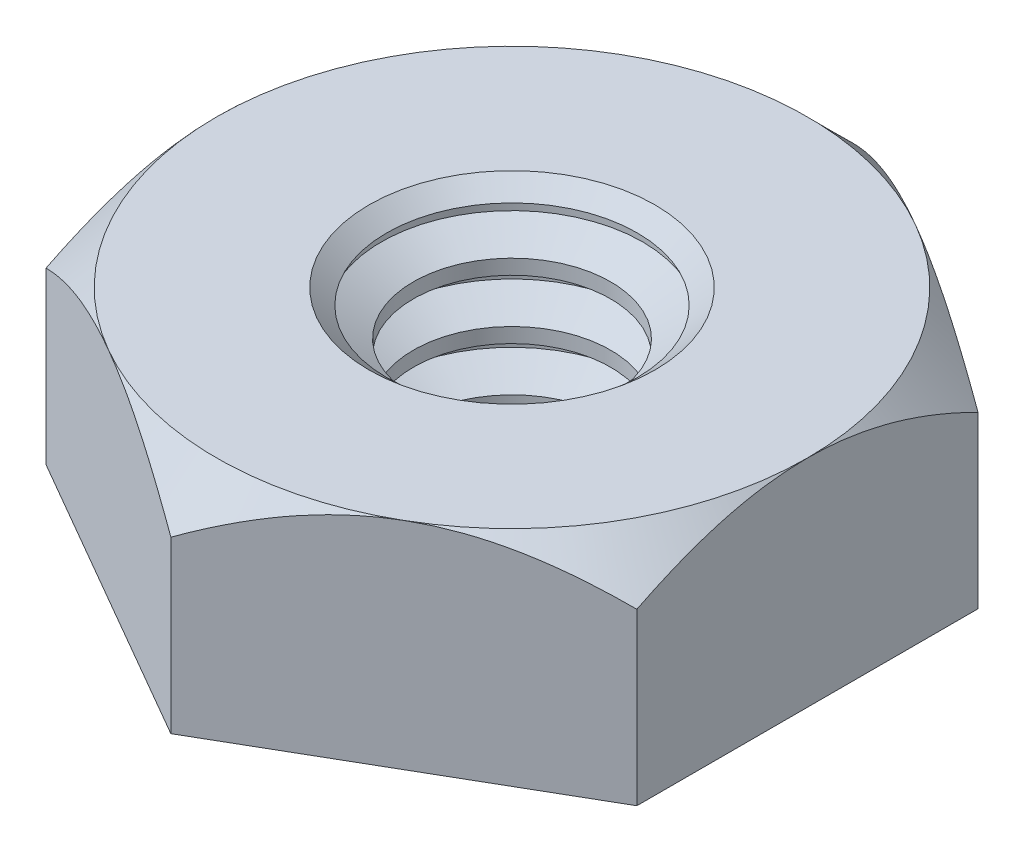
ISO-10303-21;
HEADER;
FILE_DESCRIPTION(('STEP AP214'),'2;1');
FILE_NAME('part.step','',(''),(''),'','','');
FILE_SCHEMA(('AUTOMOTIVE_DESIGN { 1 0 10303 214 1 1 1 1 }'));
ENDSEC;
DATA;
#1=APPLICATION_CONTEXT('core data for automotive mechanical design processes');
#2=APPLICATION_PROTOCOL_DEFINITION('international standard','automotive_design',2000,#1);
#3=PRODUCT_CONTEXT('',#1,'mechanical');
#4=PRODUCT('Part','Part','',(#3));
#5=PRODUCT_RELATED_PRODUCT_CATEGORY('part','',(#4));
#6=PRODUCT_DEFINITION_FORMATION('','',#4);
#7=PRODUCT_DEFINITION_CONTEXT('part definition',#1,'design');
#8=PRODUCT_DEFINITION('design','',#6,#7);
#9=PRODUCT_DEFINITION_SHAPE('','',#8);
#10=(LENGTH_UNIT() NAMED_UNIT(*) SI_UNIT(.MILLI.,.METRE.));
#11=(NAMED_UNIT(*) PLANE_ANGLE_UNIT() SI_UNIT($,.RADIAN.));
#12=(NAMED_UNIT(*) SI_UNIT($,.STERADIAN.) SOLID_ANGLE_UNIT());
#13=UNCERTAINTY_MEASURE_WITH_UNIT(LENGTH_MEASURE(1.E-05),#10,'distance_accuracy_value','');
#14=(GEOMETRIC_REPRESENTATION_CONTEXT(3) GLOBAL_UNCERTAINTY_ASSIGNED_CONTEXT((#13)) GLOBAL_UNIT_ASSIGNED_CONTEXT((#10,
#11,#12)) REPRESENTATION_CONTEXT('',''));
#15=CARTESIAN_POINT('',(0.,0.,0.));
#16=DIRECTION('',(0.,0.,1.));
#17=DIRECTION('',(1.,0.,0.));
#18=AXIS2_PLACEMENT_3D('',#15,#16,#17);
#19=CARTESIAN_POINT('',(-3.9624,0.,-6.86307811991092));
#20=DIRECTION('',(0.,1.,0.));
#21=DIRECTION('',(0.,0.,1.));
#22=AXIS2_PLACEMENT_3D('',#19,#20,#21);
#23=PLANE('',#22);
#24=DIRECTION('',(-0.866025403784439,0.,-0.5));
#25=VECTOR('',#24,1.);
#26=CARTESIAN_POINT('',(3.9624,0.,-2.28769270663698));
#27=LINE('',#26,#25);
#28=CARTESIAN_POINT('',(3.9624,0.,-2.28769270663698));
#29=VERTEX_POINT('',#28);
#30=CARTESIAN_POINT('',(0.,0.,-4.57538541327395));
#31=VERTEX_POINT('',#30);
#32=EDGE_CURVE('E271',#29,#31,#27,.T.);
#33=ORIENTED_EDGE('',*,*,#32,.F.);
#34=DIRECTION('',(0.,0.,-1.));
#35=VECTOR('',#34,1.);
#36=CARTESIAN_POINT('',(3.9624,0.,2.28769270663697));
#37=LINE('',#36,#35);
#38=CARTESIAN_POINT('',(3.9624,0.,2.28769270663697));
#39=VERTEX_POINT('',#38);
#40=EDGE_CURVE('E278',#39,#29,#37,.T.);
#41=ORIENTED_EDGE('',*,*,#40,.F.);
#42=DIRECTION('',(0.866025403784439,0.,-0.5));
#43=VECTOR('',#42,1.);
#44=CARTESIAN_POINT('',(0.,0.,4.57538541327395));
#45=LINE('',#44,#43);
#46=CARTESIAN_POINT('',(0.,0.,4.57538541327395));
#47=VERTEX_POINT('',#46);
#48=EDGE_CURVE('E274',#47,#39,#45,.T.);
#49=ORIENTED_EDGE('',*,*,#48,.F.);
#50=DIRECTION('',(0.866025403784439,0.,0.5));
#51=VECTOR('',#50,1.);
#52=CARTESIAN_POINT('',(-3.9624,0.,2.28769270663697));
#53=LINE('',#52,#51);
#54=CARTESIAN_POINT('',(-3.9624,0.,2.28769270663697));
#55=VERTEX_POINT('',#54);
#56=EDGE_CURVE('E126',#55,#47,#53,.T.);
#57=ORIENTED_EDGE('',*,*,#56,.F.);
#58=DIRECTION('',(0.,0.,1.));
#59=VECTOR('',#58,1.);
#60=CARTESIAN_POINT('',(-3.9624,0.,-2.28769270663698));
#61=LINE('',#60,#59);
#62=CARTESIAN_POINT('',(-3.9624,0.,-2.28769270663698));
#63=VERTEX_POINT('',#62);
#64=EDGE_CURVE('E270',#63,#55,#61,.T.);
#65=ORIENTED_EDGE('',*,*,#64,.F.);
#66=DIRECTION('',(-0.866025403784439,0.,0.5));
#67=VECTOR('',#66,1.);
#68=CARTESIAN_POINT('',(0.,0.,-4.57538541327395));
#69=LINE('',#68,#67);
#70=EDGE_CURVE('E266',#31,#63,#69,.T.);
#71=ORIENTED_EDGE('',*,*,#70,.F.);
#72=EDGE_LOOP('',(#33,#41,#49,#57,#65,#71));
#73=FACE_BOUND('',#72,.T.);
#74=CARTESIAN_POINT('',(0.,0.,0.));
#75=DIRECTION('',(0.,1.,0.));
#76=DIRECTION('',(0.,0.,1.));
#77=AXIS2_PLACEMENT_3D('',#74,#75,#76);
#78=CIRCLE('',#77,1.46320137334911);
#79=CARTESIAN_POINT('',(0.,0.,1.46320137334911));
#80=VERTEX_POINT('',#79);
#81=EDGE_CURVE('E143',#80,#80,#78,.F.);
#82=ORIENTED_EDGE('',*,*,#81,.F.);
#83=EDGE_LOOP('',(#82));
#84=FACE_BOUND('',#83,.T.);
#85=ADVANCED_FACE('F33',(#73,#84),#23,.F.);
#86=CARTESIAN_POINT('',(-3.9624,2.8956,-6.86307811991092));
#87=DIRECTION('',(0.,1.,0.));
#88=DIRECTION('',(0.,0.,1.));
#89=AXIS2_PLACEMENT_3D('',#86,#87,#88);
#90=PLANE('',#89);
#91=CARTESIAN_POINT('',(0.,2.8956,0.));
#92=DIRECTION('',(0.,1.,0.));
#93=DIRECTION('',(0.,0.,1.));
#94=AXIS2_PLACEMENT_3D('',#91,#92,#93);
#95=CIRCLE('',#94,1.91828270984131);
#96=CARTESIAN_POINT('',(0.,2.8956,1.91828270984131));
#97=VERTEX_POINT('',#96);
#98=EDGE_CURVE('E12',#97,#97,#95,.F.);
#99=ORIENTED_EDGE('',*,*,#98,.T.);
#100=EDGE_LOOP('',(#99));
#101=FACE_BOUND('',#100,.T.);
#102=CARTESIAN_POINT('',(0.,2.8956,0.));
#103=DIRECTION('',(0.,1.,0.));
#104=DIRECTION('',(0.,0.,1.));
#105=AXIS2_PLACEMENT_3D('',#102,#103,#104);
#106=CIRCLE('',#105,3.9624);
#107=CARTESIAN_POINT('',(-1.9812,2.8956,3.43153905995546));
#108=VERTEX_POINT('',#107);
#109=CARTESIAN_POINT('',(1.9812,2.8956,3.43153905995546));
#110=VERTEX_POINT('',#109);
#111=EDGE_CURVE('E108',#108,#110,#106,.T.);
#112=ORIENTED_EDGE('',*,*,#111,.T.);
#113=CARTESIAN_POINT('',(0.,2.8956,0.));
#114=DIRECTION('',(0.,1.,0.));
#115=DIRECTION('',(0.,0.,1.));
#116=AXIS2_PLACEMENT_3D('',#113,#114,#115);
#117=CIRCLE('',#116,3.9624);
#118=CARTESIAN_POINT('',(3.9624,2.8956,0.));
#119=VERTEX_POINT('',#118);
#120=EDGE_CURVE('E48',#110,#119,#117,.T.);
#121=ORIENTED_EDGE('',*,*,#120,.T.);
#122=CARTESIAN_POINT('',(1.9812,2.8956,-3.43153905995546));
#123=VERTEX_POINT('',#122);
#124=EDGE_CURVE('E142',#119,#123,#106,.T.);
#125=ORIENTED_EDGE('',*,*,#124,.T.);
#126=CARTESIAN_POINT('',(-1.9812,2.8956,-3.43153905995546));
#127=VERTEX_POINT('',#126);
#128=EDGE_CURVE('E150',#123,#127,#106,.T.);
#129=ORIENTED_EDGE('',*,*,#128,.T.);
#130=CARTESIAN_POINT('',(-3.9624,2.8956,0.));
#131=VERTEX_POINT('',#130);
#132=EDGE_CURVE('E153',#127,#131,#106,.T.);
#133=ORIENTED_EDGE('',*,*,#132,.T.);
#134=EDGE_CURVE('E141',#131,#108,#106,.T.);
#135=ORIENTED_EDGE('',*,*,#134,.T.);
#136=EDGE_LOOP('',(#112,#121,#125,#129,#133,#135));
#137=FACE_BOUND('',#136,.T.);
#138=ADVANCED_FACE('F160',(#101,#137),#90,.T.);
#139=CARTESIAN_POINT('',(3.9624,2.8956,-2.28769270663698));
#140=DIRECTION('',(-0.5,0.,0.866025403784439));
#141=DIRECTION('',(0.866025403784439,0.,0.5));
#142=AXIS2_PLACEMENT_3D('',#139,#140,#141);
#143=PLANE('',#142);
#144=CARTESIAN_POINT('',(3.9626,2.28249911230112,-2.28757723658314));
#145=CARTESIAN_POINT('',(3.89446549985437,2.32183254920943,-2.32691470858332));
#146=CARTESIAN_POINT('',(3.82580961109731,2.3599592566538,-2.36655320443866));
#147=CARTESIAN_POINT('',(3.68734765448941,2.43343137724804,-2.44649425235875));
#148=CARTESIAN_POINT('',(3.61754098323627,2.46877527127996,-2.48679715279799));
#149=CARTESIAN_POINT('',(3.40558506553148,2.57038240792864,-2.60916995894118));
#150=CARTESIAN_POINT('',(3.26163440530899,2.6317875873723,-2.69227991137066));
#151=CARTESIAN_POINT('',(2.97140265028788,2.73694714080634,-2.85984529325947));
#152=CARTESIAN_POINT('',(2.8251948662193,2.78096633104565,-2.94425839674909));
#153=CARTESIAN_POINT('',(2.52955080062813,2.84879291802354,-3.11494857760247));
#154=CARTESIAN_POINT('',(2.38012357354924,2.87265091929364,-3.20122042738072));
#155=CARTESIAN_POINT('',(2.12259173799768,2.89417645803485,-3.34990650196132));
#156=CARTESIAN_POINT('',(2.01481893296099,2.89736220639534,-3.41212915996057));
#157=CARTESIAN_POINT('',(1.79944824412286,2.89199204462422,-3.53647348513682));
#158=CARTESIAN_POINT('',(1.69185043487651,2.88343201840243,-3.59859510926941));
#159=CARTESIAN_POINT('',(1.47767432697131,2.85505856421184,-3.72224974282246));
#160=CARTESIAN_POINT('',(1.37109730437381,2.83523254995533,-3.78378201550856));
#161=CARTESIAN_POINT('',(1.15977366065748,2.78540938436369,-3.90578977809432));
#162=CARTESIAN_POINT('',(1.05502689984513,2.75541301287159,-3.96626534864607));
#163=CARTESIAN_POINT('',(0.869076011723867,2.69369850584552,-4.07362414395893));
#164=CARTESIAN_POINT('',(0.787460192822369,2.6636029898974,-4.12074505897184));
#165=CARTESIAN_POINT('',(0.625693710081755,2.59856182968194,-4.21414098132799));
#166=CARTESIAN_POINT('',(0.54554309090186,2.56361603785643,-4.26041596288722));
#167=CARTESIAN_POINT('',(0.386959529157497,2.48965772416721,-4.35197422494938));
#168=CARTESIAN_POINT('',(0.308522076188774,2.45065799050655,-4.39726010953542));
#169=CARTESIAN_POINT('',(0.153099743788862,2.36910391921849,-4.48699323498459));
#170=CARTESIAN_POINT('',(0.0761140082224226,2.32655176242555,-4.53144097013763));
#171=CARTESIAN_POINT('',(-0.000199999999999125,2.28249911230111,-4.57550088332779));
#172=B_SPLINE_CURVE_WITH_KNOTS('',3,(#144,#145,#146,#147,#148,#149,#150,#151,#152,#153,#154,
#155,#156,#157,#158,#159,#160,#161,#162,#163,#164,#165,#166,#167,#168,#169,#170,#171),
.UNSPECIFIED.,.F.,.F.,(4,2,2,2,2,2,2,2,2,2,2,2,2,4),(0.,0.263858416298982,0.527859886505426,
1.05871336584034,1.58113667983949,2.1022447846131,2.47517623939575,2.84823841451282,
3.2217181939671,3.59516934219896,3.89182199921682,4.18848368316856,4.4842364187439,
4.7798089081904),.UNSPECIFIED.);
#173=CARTESIAN_POINT('',(3.9624,2.28261458672606,-2.28769270663698));
#174=VERTEX_POINT('',#173);
#175=EDGE_CURVE('E281',#174,#123,#172,.T.);
#176=ORIENTED_EDGE('',*,*,#175,.F.);
#177=DIRECTION('',(0.,-1.,0.));
#178=VECTOR('',#177,1.);
#179=CARTESIAN_POINT('',(3.9624,2.8956,-2.28769270663698));
#180=LINE('',#179,#178);
#181=EDGE_CURVE('E133',#174,#29,#180,.T.);
#182=ORIENTED_EDGE('',*,*,#181,.T.);
#183=ORIENTED_EDGE('',*,*,#32,.T.);
#184=DIRECTION('',(0.,-1.,0.));
#185=VECTOR('',#184,1.);
#186=CARTESIAN_POINT('',(0.,2.8956,-4.57538541327395));
#187=LINE('',#186,#185);
#188=CARTESIAN_POINT('',(0.,2.28261458672606,-4.57538541327395));
#189=VERTEX_POINT('',#188);
#190=EDGE_CURVE('E138',#189,#31,#187,.T.);
#191=ORIENTED_EDGE('',*,*,#190,.F.);
#192=EDGE_CURVE('E217',#123,#189,#172,.T.);
#193=ORIENTED_EDGE('',*,*,#192,.F.);
#194=EDGE_LOOP('',(#176,#182,#183,#191,#193));
#195=FACE_BOUND('',#194,.T.);
#196=ADVANCED_FACE('F227',(#195),#143,.F.);
#197=CARTESIAN_POINT('',(0.,2.8956,-4.57538541327395));
#198=DIRECTION('',(0.5,0.,0.866025403784439));
#199=DIRECTION('',(0.866025403784439,0.,-0.5));
#200=AXIS2_PLACEMENT_3D('',#197,#198,#199);
#201=PLANE('',#200);
#202=CARTESIAN_POINT('',(0.000200000000000874,2.28249911230111,-4.57550088332779));
#203=CARTESIAN_POINT('',(-0.0679345001456326,2.32183254920943,-4.5361634113276));
#204=CARTESIAN_POINT('',(-0.13659038890269,2.3599592566538,-4.49652491547226));
#205=CARTESIAN_POINT('',(-0.275052345510584,2.43343137724804,-4.41658386755217));
#206=CARTESIAN_POINT('',(-0.344859016763729,2.46877527127996,-4.37628096711294));
#207=CARTESIAN_POINT('',(-0.556814934468517,2.57038240792864,-4.25390816096975));
#208=CARTESIAN_POINT('',(-0.70076559469101,2.63178758737229,-4.17079820854027));
#209=CARTESIAN_POINT('',(-0.990997349712121,2.73694714080634,-4.00323282665145));
#210=CARTESIAN_POINT('',(-1.1372051337807,2.78096633104566,-3.91881972316184));
#211=CARTESIAN_POINT('',(-1.43284919937187,2.84879291802354,-3.74812954230846));
#212=CARTESIAN_POINT('',(-1.58227642645076,2.87265091929364,-3.6618576925302));
#213=CARTESIAN_POINT('',(-1.83980826200233,2.89417645803485,-3.51317161794961));
#214=CARTESIAN_POINT('',(-1.94758106703901,2.89736220639534,-3.45094895995036));
#215=CARTESIAN_POINT('',(-2.16295175587714,2.89199204462422,-3.32660463477411));
#216=CARTESIAN_POINT('',(-2.2705495651235,2.88343201840243,-3.26448301064151));
#217=CARTESIAN_POINT('',(-2.48472567302869,2.85505856421184,-3.14082837708846));
#218=CARTESIAN_POINT('',(-2.5913026956262,2.83523254995533,-3.07929610440236));
#219=CARTESIAN_POINT('',(-2.80262633934253,2.78540938436369,-2.95728834181661));
#220=CARTESIAN_POINT('',(-2.90737310015488,2.75541301287159,-2.89681277126485));
#221=CARTESIAN_POINT('',(-3.09332398827614,2.69369850584552,-2.78945397595199));
#222=CARTESIAN_POINT('',(-3.17493980717763,2.6636029898974,-2.74233306093908));
#223=CARTESIAN_POINT('',(-3.33670628991825,2.59856182968194,-2.64893713858293));
#224=CARTESIAN_POINT('',(-3.41685690909814,2.56361603785643,-2.6026621570237));
#225=CARTESIAN_POINT('',(-3.57544047084251,2.48965772416721,-2.51110389496155));
#226=CARTESIAN_POINT('',(-3.65387792381123,2.45065799050655,-2.46581801037551));
#227=CARTESIAN_POINT('',(-3.80930025621114,2.36910391921849,-2.37608488492634));
#228=CARTESIAN_POINT('',(-3.88628599177758,2.32655176242555,-2.33163714977329));
#229=CARTESIAN_POINT('',(-3.9626,2.28249911230111,-2.28757723658314));
#230=B_SPLINE_CURVE_WITH_KNOTS('',3,(#202,#203,#204,#205,#206,#207,#208,#209,#210,#211,#212,
#213,#214,#215,#216,#217,#218,#219,#220,#221,#222,#223,#224,#225,#226,#227,#228,#229),
.UNSPECIFIED.,.F.,.F.,(4,2,2,2,2,2,2,2,2,2,2,2,2,4),(0.,0.263858416298982,0.527859886505428,
1.05871336584034,1.58113667983949,2.10224478461311,2.47517623939576,2.84823841451282,
3.2217181939671,3.59516934219896,3.89182199921682,4.18848368316857,4.4842364187439,
4.7798089081904),.UNSPECIFIED.);
#231=EDGE_CURVE('E216',#189,#127,#230,.T.);
#232=ORIENTED_EDGE('',*,*,#231,.F.);
#233=ORIENTED_EDGE('',*,*,#190,.T.);
#234=ORIENTED_EDGE('',*,*,#70,.T.);
#235=DIRECTION('',(0.,-1.,0.));
#236=VECTOR('',#235,1.);
#237=CARTESIAN_POINT('',(-3.9624,2.8956,-2.28769270663698));
#238=LINE('',#237,#236);
#239=CARTESIAN_POINT('',(-3.9624,2.28261458672606,-2.28769270663698));
#240=VERTEX_POINT('',#239);
#241=EDGE_CURVE('E131',#240,#63,#238,.T.);
#242=ORIENTED_EDGE('',*,*,#241,.F.);
#243=EDGE_CURVE('E210',#127,#240,#230,.T.);
#244=ORIENTED_EDGE('',*,*,#243,.F.);
#245=EDGE_LOOP('',(#232,#233,#234,#242,#244));
#246=FACE_BOUND('',#245,.T.);
#247=ADVANCED_FACE('F223',(#246),#201,.F.);
#248=CARTESIAN_POINT('',(-3.9624,2.8956,-2.28769270663698));
#249=DIRECTION('',(1.,0.,0.));
#250=DIRECTION('',(0.,0.,-1.));
#251=AXIS2_PLACEMENT_3D('',#248,#249,#250);
#252=PLANE('',#251);
#253=CARTESIAN_POINT('',(-3.9624,0.6536588359399,-4.77422616976311));
#254=CARTESIAN_POINT('',(-3.9624,0.742395130500174,-4.65888310116748));
#255=CARTESIAN_POINT('',(-3.9624,0.830336281782735,-4.54291854263242));
#256=CARTESIAN_POINT('',(-3.9624,1.00426502576535,-4.30949242233877));
#257=CARTESIAN_POINT('',(-3.9624,1.09025215135562,-4.19203051289899));
#258=CARTESIAN_POINT('',(-3.9624,1.26052149453473,-3.95449728975014));
#259=CARTESIAN_POINT('',(-3.9624,1.34478544128242,-3.83441283611716));
#260=CARTESIAN_POINT('',(-3.9624,1.51038092691311,-3.59224537192731));
#261=CARTESIAN_POINT('',(-3.9624,1.5917126677101,-3.4701624998281));
#262=CARTESIAN_POINT('',(-3.9624,1.75581886702444,-3.21584675027785));
#263=CARTESIAN_POINT('',(-3.9624,1.83835780189603,-3.08346112647129));
#264=CARTESIAN_POINT('',(-3.9624,1.99831260907316,-2.81558100686359));
#265=CARTESIAN_POINT('',(-3.9624,2.07572761921409,-2.68008599300786));
#266=CARTESIAN_POINT('',(-3.9624,2.22378591654813,-2.40595002736722));
#267=CARTESIAN_POINT('',(-3.9624,2.29444908217171,-2.26731989635843));
#268=CARTESIAN_POINT('',(-3.9624,2.42742049739339,-1.98614069341484));
#269=CARTESIAN_POINT('',(-3.9624,2.48973268837761,-1.84359350875457));
#270=CARTESIAN_POINT('',(-3.9624,2.59811760622575,-1.56854470533073));
#271=CARTESIAN_POINT('',(-3.9624,2.6451859709973,-1.43643945434369));
#272=CARTESIAN_POINT('',(-3.9624,2.72874848678466,-1.1688633080715));
#273=CARTESIAN_POINT('',(-3.9624,2.7652419642836,-1.03339219901045));
#274=CARTESIAN_POINT('',(-3.9624,2.82507105812285,-0.762252854000528));
#275=CARTESIAN_POINT('',(-3.9624,2.84864565462854,-0.6266382521542));
#276=CARTESIAN_POINT('',(-3.9624,2.88214517657594,-0.353724150457511));
#277=CARTESIAN_POINT('',(-3.9624,2.89207293393698,-0.216425006142658));
#278=CARTESIAN_POINT('',(-3.9624,2.89743311214419,0.0524529654276289));
#279=CARTESIAN_POINT('',(-3.9624,2.89347982701696,0.18401966075228));
#280=CARTESIAN_POINT('',(-3.9624,2.8727063982304,0.446126366144995));
#281=CARTESIAN_POINT('',(-3.9624,2.85588508585621,0.57666628186966));
#282=CARTESIAN_POINT('',(-3.9624,2.81004081344636,0.837987009791432));
#283=CARTESIAN_POINT('',(-3.9624,2.78080243133411,0.968729383884741));
#284=CARTESIAN_POINT('',(-3.9624,2.71174612715564,1.22733495474377));
#285=CARTESIAN_POINT('',(-3.9624,2.67192880596048,1.35519831458675));
#286=CARTESIAN_POINT('',(-3.9624,2.58091460167261,1.61508995507859));
#287=CARTESIAN_POINT('',(-3.9624,2.5291934814157,1.74693254532811));
#288=CARTESIAN_POINT('',(-3.9624,2.41776067016786,2.00722648974948));
#289=CARTESIAN_POINT('',(-3.9624,2.35804537621526,2.13567628335539));
#290=CARTESIAN_POINT('',(-3.9624,2.23204035296318,2.38979124643889));
#291=CARTESIAN_POINT('',(-3.9624,2.16573037429963,2.51544629295446));
#292=CARTESIAN_POINT('',(-3.9624,2.02799520687304,2.76387706034301));
#293=CARTESIAN_POINT('',(-3.9624,1.95657080569869,2.88665322069725));
#294=CARTESIAN_POINT('',(-3.9624,1.81323389617133,3.12370193473802));
#295=CARTESIAN_POINT('',(-3.9624,1.74151966139613,3.23809501590938));
#296=CARTESIAN_POINT('',(-3.9624,1.59503867282019,3.46491581912508));
#297=CARTESIAN_POINT('',(-3.9624,1.52027169015895,3.57734339291224));
#298=CARTESIAN_POINT('',(-3.9624,1.36883825466044,3.79958641953064));
#299=CARTESIAN_POINT('',(-3.9624,1.29219187215617,3.90941559736306));
#300=CARTESIAN_POINT('',(-3.9624,1.13684448745181,4.12756724593244));
#301=CARTESIAN_POINT('',(-3.9624,1.05814405746301,4.23589012366983));
#302=CARTESIAN_POINT('',(-3.9624,0.978602852717881,4.34358113259893));
#303=B_SPLINE_CURVE_WITH_KNOTS('',3,(#253,#254,#255,#256,#257,#258,#259,#260,#261,#262,#263,
#264,#265,#266,#267,#268,#269,#270,#271,#272,#273,#274,#275,#276,#277,#278,#279,#280,#281,#282,
#283,#284,#285,#286,#287,#288,#289,#290,#291,#292,#293,#294,#295,#296,#297,#298,#299,#300,#301,
#302),.UNSPECIFIED.,.F.,.F.,(4,2,2,2,2,2,2,2,2,2,2,2,2,2,2,2,2,2,2,2,2,2,2,2,4),(0.,
0.436589480831442,0.873282253246482,1.31334402640599,1.75337543846429,2.22130851957241,
2.68932013717387,3.15590841777926,3.62227570261511,4.04263278643279,4.46301663700312,
4.87533619058964,5.28757016889679,5.68179536777103,6.07605637567374,6.47745633348606,
6.87883349713402,7.30338194834427,7.72812239114751,8.15420984228471,8.58023181917959,
8.98521622647059,9.39023105085836,9.79199405755942,10.1936463122423),.UNSPECIFIED.);
#304=EDGE_CURVE('E165',#240,#131,#303,.T.);
#305=ORIENTED_EDGE('',*,*,#304,.F.);
#306=ORIENTED_EDGE('',*,*,#241,.T.);
#307=ORIENTED_EDGE('',*,*,#64,.T.);
#308=DIRECTION('',(0.,-1.,0.));
#309=VECTOR('',#308,1.);
#310=CARTESIAN_POINT('',(-3.9624,2.8956,2.28769270663697));
#311=LINE('',#310,#309);
#312=CARTESIAN_POINT('',(-3.96240000000001,2.28261458672606,2.28769270663697));
#313=VERTEX_POINT('',#312);
#314=EDGE_CURVE('E128',#313,#55,#311,.T.);
#315=ORIENTED_EDGE('',*,*,#314,.F.);
#316=EDGE_CURVE('E163',#131,#313,#303,.T.);
#317=ORIENTED_EDGE('',*,*,#316,.F.);
#318=EDGE_LOOP('',(#305,#306,#307,#315,#317));
#319=FACE_BOUND('',#318,.T.);
#320=ADVANCED_FACE('F226',(#319),#252,.F.);
#321=CARTESIAN_POINT('',(-3.9624,2.8956,2.28769270663697));
#322=DIRECTION('',(0.5,0.,-0.866025403784439));
#323=DIRECTION('',(-0.866025403784439,0.,-0.5));
#324=AXIS2_PLACEMENT_3D('',#321,#322,#323);
#325=PLANE('',#324);
#326=CARTESIAN_POINT('',(-3.9626,2.28249911230112,2.28757723658313));
#327=CARTESIAN_POINT('',(-3.89446549985437,2.32183254920943,2.32691470858332));
#328=CARTESIAN_POINT('',(-3.82580961109731,2.3599592566538,2.36655320443866));
#329=CARTESIAN_POINT('',(-3.68734765448942,2.43343137724804,2.44649425235875));
#330=CARTESIAN_POINT('',(-3.61754098323627,2.46877527127996,2.48679715279798));
#331=CARTESIAN_POINT('',(-3.40558506553148,2.57038240792864,2.60916995894117));
#332=CARTESIAN_POINT('',(-3.26163440530899,2.6317875873723,2.69227991137066));
#333=CARTESIAN_POINT('',(-2.97140265028788,2.73694714080634,2.85984529325947));
#334=CARTESIAN_POINT('',(-2.8251948662193,2.78096633104566,2.94425839674908));
#335=CARTESIAN_POINT('',(-2.52955080062813,2.84879291802354,3.11494857760246));
#336=CARTESIAN_POINT('',(-2.38012357354924,2.87265091929364,3.20122042738072));
#337=CARTESIAN_POINT('',(-2.12259173799768,2.89417645803485,3.34990650196131));
#338=CARTESIAN_POINT('',(-2.01481893296099,2.89736220639534,3.41212915996056));
#339=CARTESIAN_POINT('',(-1.79944824412286,2.89199204462422,3.53647348513681));
#340=CARTESIAN_POINT('',(-1.69185043487651,2.88343201840243,3.59859510926941));
#341=CARTESIAN_POINT('',(-1.47767432697131,2.85505856421184,3.72224974282246));
#342=CARTESIAN_POINT('',(-1.37109730437381,2.83523254995533,3.78378201550856));
#343=CARTESIAN_POINT('',(-1.15977366065748,2.78540938436369,3.90578977809431));
#344=CARTESIAN_POINT('',(-1.05502689984513,2.75541301287159,3.96626534864606));
#345=CARTESIAN_POINT('',(-0.869076011723868,2.69369850584553,4.07362414395892));
#346=CARTESIAN_POINT('',(-0.78746019282237,2.66360298989741,4.12074505897184));
#347=CARTESIAN_POINT('',(-0.625693710081756,2.59856182968194,4.21414098132799));
#348=CARTESIAN_POINT('',(-0.54554309090186,2.56361603785643,4.26041596288722));
#349=CARTESIAN_POINT('',(-0.386959529157497,2.48965772416721,4.35197422494937));
#350=CARTESIAN_POINT('',(-0.308522076188775,2.45065799050655,4.39726010953541));
#351=CARTESIAN_POINT('',(-0.153099743788863,2.3691039192185,4.48699323498458));
#352=CARTESIAN_POINT('',(-0.0761140082224228,2.32655176242555,4.53144097013763));
#353=CARTESIAN_POINT('',(0.000199999999999554,2.28249911230112,4.57550088332778));
#354=B_SPLINE_CURVE_WITH_KNOTS('',3,(#326,#327,#328,#329,#330,#331,#332,#333,#334,#335,#336,
#337,#338,#339,#340,#341,#342,#343,#344,#345,#346,#347,#348,#349,#350,#351,#352,#353),
.UNSPECIFIED.,.F.,.F.,(4,2,2,2,2,2,2,2,2,2,2,2,2,4),(0.,0.263858416298982,0.527859886505426,
1.05871336584034,1.58113667983949,2.1022447846131,2.47517623939576,2.84823841451282,
3.2217181939671,3.59516934219896,3.89182199921682,4.18848368316856,4.4842364187439,
4.7798089081904),.UNSPECIFIED.);
#355=EDGE_CURVE('E113',#313,#108,#354,.T.);
#356=ORIENTED_EDGE('',*,*,#355,.F.);
#357=ORIENTED_EDGE('',*,*,#314,.T.);
#358=ORIENTED_EDGE('',*,*,#56,.T.);
#359=DIRECTION('',(0.,-1.,0.));
#360=VECTOR('',#359,1.);
#361=CARTESIAN_POINT('',(0.,2.8956,4.57538541327395));
#362=LINE('',#361,#360);
#363=CARTESIAN_POINT('',(0.,2.28261458672606,4.57538541327395));
#364=VERTEX_POINT('',#363);
#365=EDGE_CURVE('E119',#364,#47,#362,.T.);
#366=ORIENTED_EDGE('',*,*,#365,.F.);
#367=EDGE_CURVE('E104',#108,#364,#354,.T.);
#368=ORIENTED_EDGE('',*,*,#367,.F.);
#369=EDGE_LOOP('',(#356,#357,#358,#366,#368));
#370=FACE_BOUND('',#369,.T.);
#371=ADVANCED_FACE('F124',(#370),#325,.F.);
#372=CARTESIAN_POINT('',(0.,2.8956,4.57538541327395));
#373=DIRECTION('',(-0.5,0.,-0.866025403784439));
#374=DIRECTION('',(-0.866025403784439,0.,0.5));
#375=AXIS2_PLACEMENT_3D('',#372,#373,#374);
#376=PLANE('',#375);
#377=CARTESIAN_POINT('',(-0.000200000000000771,2.28249911230112,4.57550088332778));
#378=CARTESIAN_POINT('',(0.0679345001456329,2.32183254920943,4.5361634113276));
#379=CARTESIAN_POINT('',(0.13659038890269,2.3599592566538,4.49652491547226));
#380=CARTESIAN_POINT('',(0.275052345510584,2.43343137724805,4.41658386755217));
#381=CARTESIAN_POINT('',(0.344859016763728,2.46877527127996,4.37628096711294));
#382=CARTESIAN_POINT('',(0.556814934468516,2.57038240792864,4.25390816096974));
#383=CARTESIAN_POINT('',(0.700765594691009,2.6317875873723,4.17079820854026));
#384=CARTESIAN_POINT('',(0.99099734971212,2.73694714080635,4.00323282665145));
#385=CARTESIAN_POINT('',(1.1372051337807,2.78096633104566,3.91881972316184));
#386=CARTESIAN_POINT('',(1.43284919937187,2.84879291802354,3.74812954230846));
#387=CARTESIAN_POINT('',(1.58227642645076,2.87265091929364,3.6618576925302));
#388=CARTESIAN_POINT('',(1.83980826200232,2.89417645803485,3.51317161794961));
#389=CARTESIAN_POINT('',(1.94758106703901,2.89736220639534,3.45094895995036));
#390=CARTESIAN_POINT('',(2.16295175587714,2.89199204462422,3.32660463477411));
#391=CARTESIAN_POINT('',(2.2705495651235,2.88343201840243,3.26448301064151));
#392=CARTESIAN_POINT('',(2.48472567302869,2.85505856421184,3.14082837708846));
#393=CARTESIAN_POINT('',(2.59130269562619,2.83523254995533,3.07929610440236));
#394=CARTESIAN_POINT('',(2.80262633934252,2.78540938436369,2.95728834181661));
#395=CARTESIAN_POINT('',(2.90737310015488,2.75541301287159,2.89681277126485));
#396=CARTESIAN_POINT('',(3.09332398827613,2.69369850584552,2.78945397595199));
#397=CARTESIAN_POINT('',(3.17493980717763,2.6636029898974,2.74233306093908));
#398=CARTESIAN_POINT('',(3.33670628991825,2.59856182968194,2.64893713858293));
#399=CARTESIAN_POINT('',(3.41685690909814,2.56361603785643,2.6026621570237));
#400=CARTESIAN_POINT('',(3.5754404708425,2.48965772416721,2.51110389496155));
#401=CARTESIAN_POINT('',(3.65387792381123,2.45065799050655,2.46581801037551));
#402=CARTESIAN_POINT('',(3.80930025621114,2.36910391921849,2.37608488492634));
#403=CARTESIAN_POINT('',(3.88628599177758,2.32655176242555,2.33163714977329));
#404=CARTESIAN_POINT('',(3.9626,2.28249911230112,2.28757723658314));
#405=B_SPLINE_CURVE_WITH_KNOTS('',3,(#377,#378,#379,#380,#381,#382,#383,#384,#385,#386,#387,
#388,#389,#390,#391,#392,#393,#394,#395,#396,#397,#398,#399,#400,#401,#402,#403,#404),
.UNSPECIFIED.,.F.,.F.,(4,2,2,2,2,2,2,2,2,2,2,2,2,4),(0.,0.263858416298983,0.527859886505427,
1.05871336584034,1.58113667983949,2.1022447846131,2.47517623939576,2.84823841451282,
3.2217181939671,3.59516934219896,3.89182199921682,4.18848368316856,4.4842364187439,
4.77980890819039),.UNSPECIFIED.);
#406=EDGE_CURVE('E107',#364,#110,#405,.T.);
#407=ORIENTED_EDGE('',*,*,#406,.F.);
#408=ORIENTED_EDGE('',*,*,#365,.T.);
#409=ORIENTED_EDGE('',*,*,#48,.T.);
#410=DIRECTION('',(0.,-1.,0.));
#411=VECTOR('',#410,1.);
#412=CARTESIAN_POINT('',(3.9624,2.8956,2.28769270663697));
#413=LINE('',#412,#411);
#414=CARTESIAN_POINT('',(3.9624,2.28261458672606,2.28769270663698));
#415=VERTEX_POINT('',#414);
#416=EDGE_CURVE('E129',#415,#39,#413,.T.);
#417=ORIENTED_EDGE('',*,*,#416,.F.);
#418=EDGE_CURVE('E122',#110,#415,#405,.T.);
#419=ORIENTED_EDGE('',*,*,#418,.F.);
#420=EDGE_LOOP('',(#407,#408,#409,#417,#419));
#421=FACE_BOUND('',#420,.T.);
#422=ADVANCED_FACE('F117',(#421),#376,.F.);
#423=CARTESIAN_POINT('',(3.9624,2.8956,2.28769270663697));
#424=DIRECTION('',(-1.,0.,0.));
#425=DIRECTION('',(0.,0.,1.));
#426=AXIS2_PLACEMENT_3D('',#423,#424,#425);
#427=PLANE('',#426);
#428=CARTESIAN_POINT('',(3.9624,0.653658835939899,-4.77422616976311));
#429=CARTESIAN_POINT('',(3.9624,0.742395130500173,-4.65888310116748));
#430=CARTESIAN_POINT('',(3.9624,0.830336281782733,-4.54291854263243));
#431=CARTESIAN_POINT('',(3.9624,1.00426502576535,-4.30949242233878));
#432=CARTESIAN_POINT('',(3.9624,1.09025215135562,-4.19203051289899));
#433=CARTESIAN_POINT('',(3.9624,1.26052149453473,-3.95449728975014));
#434=CARTESIAN_POINT('',(3.9624,1.34478544128242,-3.83441283611716));
#435=CARTESIAN_POINT('',(3.9624,1.51038092691311,-3.59224537192731));
#436=CARTESIAN_POINT('',(3.9624,1.5917126677101,-3.4701624998281));
#437=CARTESIAN_POINT('',(3.9624,1.75581886702444,-3.21584675027785));
#438=CARTESIAN_POINT('',(3.9624,1.83835780189603,-3.08346112647129));
#439=CARTESIAN_POINT('',(3.9624,1.99831260907316,-2.81558100686359));
#440=CARTESIAN_POINT('',(3.9624,2.07572761921409,-2.68008599300786));
#441=CARTESIAN_POINT('',(3.9624,2.22378591654813,-2.40595002736722));
#442=CARTESIAN_POINT('',(3.9624,2.29444908217171,-2.26731989635844));
#443=CARTESIAN_POINT('',(3.9624,2.42742049739339,-1.98614069341485));
#444=CARTESIAN_POINT('',(3.9624,2.48973268837761,-1.84359350875457));
#445=CARTESIAN_POINT('',(3.9624,2.59811760622576,-1.56854470533073));
#446=CARTESIAN_POINT('',(3.9624,2.6451859709973,-1.4364394543437));
#447=CARTESIAN_POINT('',(3.9624,2.72874848678466,-1.1688633080715));
#448=CARTESIAN_POINT('',(3.9624,2.7652419642836,-1.03339219901045));
#449=CARTESIAN_POINT('',(3.9624,2.82507105812285,-0.76225285400053));
#450=CARTESIAN_POINT('',(3.9624,2.84864565462854,-0.626638252154201));
#451=CARTESIAN_POINT('',(3.9624,2.88214517657594,-0.353724150457511));
#452=CARTESIAN_POINT('',(3.9624,2.89207293393698,-0.216425006142658));
#453=CARTESIAN_POINT('',(3.9624,2.89743311214419,0.0524529654276283));
#454=CARTESIAN_POINT('',(3.9624,2.89347982701696,0.184019660752279));
#455=CARTESIAN_POINT('',(3.9624,2.8727063982304,0.446126366144994));
#456=CARTESIAN_POINT('',(3.9624,2.85588508585621,0.57666628186966));
#457=CARTESIAN_POINT('',(3.9624,2.81004081344637,0.837987009791431));
#458=CARTESIAN_POINT('',(3.9624,2.78080243133411,0.96872938388474));
#459=CARTESIAN_POINT('',(3.9624,2.71174612715564,1.22733495474377));
#460=CARTESIAN_POINT('',(3.9624,2.67192880596048,1.35519831458675));
#461=CARTESIAN_POINT('',(3.9624,2.58091460167261,1.6150899550786));
#462=CARTESIAN_POINT('',(3.9624,2.52919348141571,1.74693254532811));
#463=CARTESIAN_POINT('',(3.9624,2.41776067016786,2.00722648974948));
#464=CARTESIAN_POINT('',(3.9624,2.35804537621526,2.13567628335539));
#465=CARTESIAN_POINT('',(3.9624,2.23204035296318,2.38979124643889));
#466=CARTESIAN_POINT('',(3.9624,2.16573037429963,2.51544629295446));
#467=CARTESIAN_POINT('',(3.9624,2.02799520687304,2.76387706034302));
#468=CARTESIAN_POINT('',(3.9624,1.95657080569869,2.88665322069725));
#469=CARTESIAN_POINT('',(3.9624,1.81323389617133,3.12370193473803));
#470=CARTESIAN_POINT('',(3.9624,1.74151966139613,3.23809501590938));
#471=CARTESIAN_POINT('',(3.9624,1.59503867282019,3.46491581912509));
#472=CARTESIAN_POINT('',(3.9624,1.52027169015895,3.57734339291224));
#473=CARTESIAN_POINT('',(3.9624,1.36883825466044,3.79958641953064));
#474=CARTESIAN_POINT('',(3.9624,1.29219187215617,3.90941559736306));
#475=CARTESIAN_POINT('',(3.9624,1.13684448745181,4.12756724593245));
#476=CARTESIAN_POINT('',(3.9624,1.05814405746301,4.23589012366983));
#477=CARTESIAN_POINT('',(3.9624,0.97860285271788,4.34358113259893));
#478=B_SPLINE_CURVE_WITH_KNOTS('',3,(#428,#429,#430,#431,#432,#433,#434,#435,#436,#437,#438,
#439,#440,#441,#442,#443,#444,#445,#446,#447,#448,#449,#450,#451,#452,#453,#454,#455,#456,#457,
#458,#459,#460,#461,#462,#463,#464,#465,#466,#467,#468,#469,#470,#471,#472,#473,#474,#475,#476,
#477),.UNSPECIFIED.,.F.,.F.,(4,2,2,2,2,2,2,2,2,2,2,2,2,2,2,2,2,2,2,2,2,2,2,2,4),(0.,
0.436589480831441,0.873282253246482,1.31334402640599,1.75337543846429,2.22130851957241,
2.68932013717387,3.15590841777926,3.62227570261511,4.04263278643279,4.46301663700312,
4.87533619058965,5.28757016889679,5.68179536777103,6.07605637567374,6.47745633348606,
6.87883349713402,7.30338194834427,7.72812239114751,8.15420984228471,8.5802318191796,
8.98521622647059,9.39023105085836,9.79199405755943,10.1936463122423),.UNSPECIFIED.);
#479=EDGE_CURVE('E302',#415,#119,#478,.F.);
#480=ORIENTED_EDGE('',*,*,#479,.F.);
#481=ORIENTED_EDGE('',*,*,#416,.T.);
#482=ORIENTED_EDGE('',*,*,#40,.T.);
#483=ORIENTED_EDGE('',*,*,#181,.F.);
#484=EDGE_CURVE('E199',#119,#174,#478,.F.);
#485=ORIENTED_EDGE('',*,*,#484,.F.);
#486=EDGE_LOOP('',(#480,#481,#482,#483,#485));
#487=FACE_BOUND('',#486,.T.);
#488=ADVANCED_FACE('F244',(#487),#427,.F.);
#489=CARTESIAN_POINT('',(0.,2.8956,0.));
#490=DIRECTION('',(0.,-1.,0.));
#491=DIRECTION('',(0.,0.,-1.));
#492=AXIS2_PLACEMENT_3D('',#489,#490,#491);
#493=CONICAL_SURFACE('',#492,3.9624,0.785398163397454);
#494=ORIENTED_EDGE('',*,*,#367,.T.);
#495=ORIENTED_EDGE('',*,*,#406,.T.);
#496=ORIENTED_EDGE('',*,*,#111,.F.);
#497=EDGE_LOOP('',(#494,#495,#496));
#498=FACE_BOUND('',#497,.T.);
#499=ADVANCED_FACE('F106',(#498),#493,.T.);
#500=ORIENTED_EDGE('',*,*,#316,.T.);
#501=ORIENTED_EDGE('',*,*,#355,.T.);
#502=ORIENTED_EDGE('',*,*,#134,.F.);
#503=EDGE_LOOP('',(#500,#501,#502));
#504=FACE_BOUND('',#503,.T.);
#505=ADVANCED_FACE('F162',(#504),#493,.T.);
#506=ORIENTED_EDGE('',*,*,#243,.T.);
#507=ORIENTED_EDGE('',*,*,#304,.T.);
#508=ORIENTED_EDGE('',*,*,#132,.F.);
#509=EDGE_LOOP('',(#506,#507,#508));
#510=FACE_BOUND('',#509,.T.);
#511=ADVANCED_FACE('F286',(#510),#493,.T.);
#512=ORIENTED_EDGE('',*,*,#192,.T.);
#513=ORIENTED_EDGE('',*,*,#231,.T.);
#514=ORIENTED_EDGE('',*,*,#128,.F.);
#515=EDGE_LOOP('',(#512,#513,#514));
#516=FACE_BOUND('',#515,.T.);
#517=ADVANCED_FACE('F192',(#516),#493,.T.);
#518=ORIENTED_EDGE('',*,*,#175,.T.);
#519=ORIENTED_EDGE('',*,*,#124,.F.);
#520=ORIENTED_EDGE('',*,*,#484,.T.);
#521=EDGE_LOOP('',(#518,#519,#520));
#522=FACE_BOUND('',#521,.T.);
#523=ADVANCED_FACE('F186',(#522),#493,.T.);
#524=ORIENTED_EDGE('',*,*,#418,.T.);
#525=ORIENTED_EDGE('',*,*,#479,.T.);
#526=ORIENTED_EDGE('',*,*,#120,.F.);
#527=EDGE_LOOP('',(#524,#525,#526));
#528=FACE_BOUND('',#527,.T.);
#529=ADVANCED_FACE('F191',(#528),#493,.T.);
#530=CARTESIAN_POINT('',(0.,2.647553125,0.));
#531=DIRECTION('',(0.,-1.,0.));
#532=DIRECTION('',(0.,0.,-1.));
#533=AXIS2_PLACEMENT_3D('',#530,#531,#532);
#534=CONICAL_SURFACE('',#533,1.7526,1.0471975511966);
#535=CARTESIAN_POINT('',(0.,2.68906775897641,0.));
#536=DIRECTION('',(0.,1.,0.));
#537=DIRECTION('',(0.,0.,1.));
#538=AXIS2_PLACEMENT_3D('',#535,#536,#537);
#539=CIRCLE('',#538,1.68069454469522);
#540=CARTESIAN_POINT('',(0.,2.68906775897641,1.68069454469522));
#541=VERTEX_POINT('',#540);
#542=EDGE_CURVE('E41',#541,#541,#539,.T.);
#543=ORIENTED_EDGE('',*,*,#542,.T.);
#544=EDGE_LOOP('',(#543));
#545=FACE_BOUND('',#544,.T.);
#546=CARTESIAN_POINT('',(0.,2.647553125,0.));
#547=DIRECTION('',(0.,1.,0.));
#548=DIRECTION('',(0.,0.,1.));
#549=AXIS2_PLACEMENT_3D('',#546,#547,#548);
#550=CIRCLE('',#549,1.7526);
#551=CARTESIAN_POINT('',(0.,2.647553125,1.7526));
#552=VERTEX_POINT('',#551);
#553=EDGE_CURVE('E303',#552,#552,#550,.T.);
#554=ORIENTED_EDGE('',*,*,#553,.F.);
#555=EDGE_LOOP('',(#554));
#556=FACE_BOUND('',#555,.T.);
#557=ADVANCED_FACE('F194',(#545,#556),#534,.F.);
#558=CARTESIAN_POINT('',(0.,1.66357854098429,0.));
#559=DIRECTION('',(0.,1.,0.));
#560=DIRECTION('',(0.,0.,1.));
#561=AXIS2_PLACEMENT_3D('',#558,#559,#560);
#562=CYLINDRICAL_SURFACE('',#561,1.7526);
#563=ORIENTED_EDGE('',*,*,#553,.T.);
#564=EDGE_LOOP('',(#563));
#565=FACE_BOUND('',#564,.T.);
#566=CARTESIAN_POINT('',(0.,2.548334375,0.));
#567=DIRECTION('',(0.,1.,0.));
#568=DIRECTION('',(0.,0.,1.));
#569=AXIS2_PLACEMENT_3D('',#566,#567,#568);
#570=CIRCLE('',#569,1.7526);
#571=CARTESIAN_POINT('',(0.,2.548334375,1.7526));
#572=VERTEX_POINT('',#571);
#573=EDGE_CURVE('E305',#572,#572,#570,.T.);
#574=ORIENTED_EDGE('',*,*,#573,.F.);
#575=EDGE_LOOP('',(#574));
#576=FACE_BOUND('',#575,.T.);
#577=ADVANCED_FACE('F301',(#565,#576),#562,.F.);
#578=CARTESIAN_POINT('',(0.,2.3002875,0.));
#579=DIRECTION('',(0.,1.,0.));
#580=DIRECTION('',(0.,0.,1.));
#581=AXIS2_PLACEMENT_3D('',#578,#579,#580);
#582=CONICAL_SURFACE('',#581,1.32297020984131,1.0471975511966);
#583=ORIENTED_EDGE('',*,*,#573,.T.);
#584=EDGE_LOOP('',(#583));
#585=FACE_BOUND('',#584,.T.);
#586=CARTESIAN_POINT('',(0.,2.3002875,0.));
#587=DIRECTION('',(0.,1.,0.));
#588=DIRECTION('',(0.,0.,1.));
#589=AXIS2_PLACEMENT_3D('',#586,#587,#588);
#590=CIRCLE('',#589,1.32297020984131);
#591=CARTESIAN_POINT('',(0.,2.3002875,1.32297020984131));
#592=VERTEX_POINT('',#591);
#593=EDGE_CURVE('E310',#592,#592,#590,.T.);
#594=ORIENTED_EDGE('',*,*,#593,.F.);
#595=EDGE_LOOP('',(#594));
#596=FACE_BOUND('',#595,.T.);
#597=ADVANCED_FACE('F397',(#585,#596),#582,.F.);
#598=CARTESIAN_POINT('',(0.,1.66357854098429,0.));
#599=DIRECTION('',(0.,1.,0.));
#600=DIRECTION('',(0.,0.,1.));
#601=AXIS2_PLACEMENT_3D('',#598,#599,#600);
#602=CYLINDRICAL_SURFACE('',#601,1.32297020984131);
#603=ORIENTED_EDGE('',*,*,#593,.T.);
#604=EDGE_LOOP('',(#603));
#605=FACE_BOUND('',#604,.T.);
#606=CARTESIAN_POINT('',(0.,2.10185,0.));
#607=DIRECTION('',(0.,1.,0.));
#608=DIRECTION('',(0.,0.,1.));
#609=AXIS2_PLACEMENT_3D('',#606,#607,#608);
#610=CIRCLE('',#609,1.32297020984131);
#611=CARTESIAN_POINT('',(0.,2.10185,1.32297020984131));
#612=VERTEX_POINT('',#611);
#613=EDGE_CURVE('E313',#612,#612,#610,.T.);
#614=ORIENTED_EDGE('',*,*,#613,.F.);
#615=EDGE_LOOP('',(#614));
#616=FACE_BOUND('',#615,.T.);
#617=ADVANCED_FACE('F393',(#605,#616),#602,.F.);
#618=CARTESIAN_POINT('',(0.,1.853803125,0.));
#619=DIRECTION('',(0.,-1.,0.));
#620=DIRECTION('',(0.,0.,-1.));
#621=AXIS2_PLACEMENT_3D('',#618,#619,#620);
#622=CONICAL_SURFACE('',#621,1.7526,1.0471975511966);
#623=ORIENTED_EDGE('',*,*,#613,.T.);
#624=EDGE_LOOP('',(#623));
#625=FACE_BOUND('',#624,.T.);
#626=CARTESIAN_POINT('',(0.,1.853803125,0.));
#627=DIRECTION('',(0.,1.,0.));
#628=DIRECTION('',(0.,0.,1.));
#629=AXIS2_PLACEMENT_3D('',#626,#627,#628);
#630=CIRCLE('',#629,1.7526);
#631=CARTESIAN_POINT('',(0.,1.853803125,1.7526));
#632=VERTEX_POINT('',#631);
#633=EDGE_CURVE('E316',#632,#632,#630,.T.);
#634=ORIENTED_EDGE('',*,*,#633,.F.);
#635=EDGE_LOOP('',(#634));
#636=FACE_BOUND('',#635,.T.);
#637=ADVANCED_FACE('F389',(#625,#636),#622,.F.);
#638=CARTESIAN_POINT('',(0.,0.869828540984293,0.));
#639=DIRECTION('',(0.,1.,0.));
#640=DIRECTION('',(0.,0.,1.));
#641=AXIS2_PLACEMENT_3D('',#638,#639,#640);
#642=CYLINDRICAL_SURFACE('',#641,1.7526);
#643=ORIENTED_EDGE('',*,*,#633,.T.);
#644=EDGE_LOOP('',(#643));
#645=FACE_BOUND('',#644,.T.);
#646=CARTESIAN_POINT('',(0.,1.754584375,0.));
#647=DIRECTION('',(0.,1.,0.));
#648=DIRECTION('',(0.,0.,1.));
#649=AXIS2_PLACEMENT_3D('',#646,#647,#648);
#650=CIRCLE('',#649,1.7526);
#651=CARTESIAN_POINT('',(0.,1.754584375,1.7526));
#652=VERTEX_POINT('',#651);
#653=EDGE_CURVE('E319',#652,#652,#650,.T.);
#654=ORIENTED_EDGE('',*,*,#653,.F.);
#655=EDGE_LOOP('',(#654));
#656=FACE_BOUND('',#655,.T.);
#657=ADVANCED_FACE('F385',(#645,#656),#642,.F.);
#658=CARTESIAN_POINT('',(0.,1.5065375,0.));
#659=DIRECTION('',(0.,1.,0.));
#660=DIRECTION('',(0.,0.,1.));
#661=AXIS2_PLACEMENT_3D('',#658,#659,#660);
#662=CONICAL_SURFACE('',#661,1.32297020984131,1.0471975511966);
#663=ORIENTED_EDGE('',*,*,#653,.T.);
#664=EDGE_LOOP('',(#663));
#665=FACE_BOUND('',#664,.T.);
#666=CARTESIAN_POINT('',(0.,1.5065375,0.));
#667=DIRECTION('',(0.,1.,0.));
#668=DIRECTION('',(0.,0.,1.));
#669=AXIS2_PLACEMENT_3D('',#666,#667,#668);
#670=CIRCLE('',#669,1.32297020984131);
#671=CARTESIAN_POINT('',(0.,1.5065375,1.32297020984131));
#672=VERTEX_POINT('',#671);
#673=EDGE_CURVE('E322',#672,#672,#670,.T.);
#674=ORIENTED_EDGE('',*,*,#673,.F.);
#675=EDGE_LOOP('',(#674));
#676=FACE_BOUND('',#675,.T.);
#677=ADVANCED_FACE('F381',(#665,#676),#662,.F.);
#678=CARTESIAN_POINT('',(0.,0.869828540984293,0.));
#679=DIRECTION('',(0.,1.,0.));
#680=DIRECTION('',(0.,0.,1.));
#681=AXIS2_PLACEMENT_3D('',#678,#679,#680);
#682=CYLINDRICAL_SURFACE('',#681,1.32297020984131);
#683=ORIENTED_EDGE('',*,*,#673,.T.);
#684=EDGE_LOOP('',(#683));
#685=FACE_BOUND('',#684,.T.);
#686=CARTESIAN_POINT('',(0.,1.3081,0.));
#687=DIRECTION('',(0.,1.,0.));
#688=DIRECTION('',(0.,0.,1.));
#689=AXIS2_PLACEMENT_3D('',#686,#687,#688);
#690=CIRCLE('',#689,1.32297020984131);
#691=CARTESIAN_POINT('',(0.,1.3081,1.32297020984131));
#692=VERTEX_POINT('',#691);
#693=EDGE_CURVE('E325',#692,#692,#690,.T.);
#694=ORIENTED_EDGE('',*,*,#693,.F.);
#695=EDGE_LOOP('',(#694));
#696=FACE_BOUND('',#695,.T.);
#697=ADVANCED_FACE('F377',(#685,#696),#682,.F.);
#698=CARTESIAN_POINT('',(0.,1.060053125,0.));
#699=DIRECTION('',(0.,-1.,0.));
#700=DIRECTION('',(0.,0.,-1.));
#701=AXIS2_PLACEMENT_3D('',#698,#699,#700);
#702=CONICAL_SURFACE('',#701,1.7526,1.0471975511966);
#703=ORIENTED_EDGE('',*,*,#693,.T.);
#704=EDGE_LOOP('',(#703));
#705=FACE_BOUND('',#704,.T.);
#706=CARTESIAN_POINT('',(0.,1.060053125,0.));
#707=DIRECTION('',(0.,1.,0.));
#708=DIRECTION('',(0.,0.,1.));
#709=AXIS2_PLACEMENT_3D('',#706,#707,#708);
#710=CIRCLE('',#709,1.7526);
#711=CARTESIAN_POINT('',(0.,1.060053125,1.7526));
#712=VERTEX_POINT('',#711);
#713=EDGE_CURVE('E328',#712,#712,#710,.T.);
#714=ORIENTED_EDGE('',*,*,#713,.F.);
#715=EDGE_LOOP('',(#714));
#716=FACE_BOUND('',#715,.T.);
#717=ADVANCED_FACE('F373',(#705,#716),#702,.F.);
#718=CARTESIAN_POINT('',(0.,0.0760785409842932,0.));
#719=DIRECTION('',(0.,1.,0.));
#720=DIRECTION('',(0.,0.,1.));
#721=AXIS2_PLACEMENT_3D('',#718,#719,#720);
#722=CYLINDRICAL_SURFACE('',#721,1.7526);
#723=ORIENTED_EDGE('',*,*,#713,.T.);
#724=EDGE_LOOP('',(#723));
#725=FACE_BOUND('',#724,.T.);
#726=CARTESIAN_POINT('',(0.,0.960834375,0.));
#727=DIRECTION('',(0.,1.,0.));
#728=DIRECTION('',(0.,0.,1.));
#729=AXIS2_PLACEMENT_3D('',#726,#727,#728);
#730=CIRCLE('',#729,1.7526);
#731=CARTESIAN_POINT('',(0.,0.960834375,1.7526));
#732=VERTEX_POINT('',#731);
#733=EDGE_CURVE('E331',#732,#732,#730,.T.);
#734=ORIENTED_EDGE('',*,*,#733,.F.);
#735=EDGE_LOOP('',(#734));
#736=FACE_BOUND('',#735,.T.);
#737=ADVANCED_FACE('F369',(#725,#736),#722,.F.);
#738=CARTESIAN_POINT('',(0.,0.7127875,0.));
#739=DIRECTION('',(0.,1.,0.));
#740=DIRECTION('',(0.,0.,1.));
#741=AXIS2_PLACEMENT_3D('',#738,#739,#740);
#742=CONICAL_SURFACE('',#741,1.32297020984131,1.0471975511966);
#743=ORIENTED_EDGE('',*,*,#733,.T.);
#744=EDGE_LOOP('',(#743));
#745=FACE_BOUND('',#744,.T.);
#746=CARTESIAN_POINT('',(0.,0.7127875,0.));
#747=DIRECTION('',(0.,1.,0.));
#748=DIRECTION('',(0.,0.,1.));
#749=AXIS2_PLACEMENT_3D('',#746,#747,#748);
#750=CIRCLE('',#749,1.32297020984131);
#751=CARTESIAN_POINT('',(0.,0.7127875,1.32297020984131));
#752=VERTEX_POINT('',#751);
#753=EDGE_CURVE('E145',#752,#752,#750,.T.);
#754=ORIENTED_EDGE('',*,*,#753,.F.);
#755=EDGE_LOOP('',(#754));
#756=FACE_BOUND('',#755,.T.);
#757=ADVANCED_FACE('F365',(#745,#756),#742,.F.);
#758=CARTESIAN_POINT('',(0.,0.0760785409842932,0.));
#759=DIRECTION('',(0.,1.,0.));
#760=DIRECTION('',(0.,0.,1.));
#761=AXIS2_PLACEMENT_3D('',#758,#759,#760);
#762=CYLINDRICAL_SURFACE('',#761,1.32297020984131);
#763=ORIENTED_EDGE('',*,*,#753,.T.);
#764=EDGE_LOOP('',(#763));
#765=FACE_BOUND('',#764,.T.);
#766=CARTESIAN_POINT('',(0.,0.51435,0.));
#767=DIRECTION('',(0.,1.,0.));
#768=DIRECTION('',(0.,0.,1.));
#769=AXIS2_PLACEMENT_3D('',#766,#767,#768);
#770=CIRCLE('',#769,1.32297020984131);
#771=CARTESIAN_POINT('',(0.,0.51435,1.32297020984131));
#772=VERTEX_POINT('',#771);
#773=EDGE_CURVE('E146',#772,#772,#770,.T.);
#774=ORIENTED_EDGE('',*,*,#773,.F.);
#775=EDGE_LOOP('',(#774));
#776=FACE_BOUND('',#775,.T.);
#777=ADVANCED_FACE('F362',(#765,#776),#762,.F.);
#778=CARTESIAN_POINT('',(0.,-0.0809625000000001,0.));
#779=DIRECTION('',(0.,1.,0.));
#780=DIRECTION('',(0.,0.,1.));
#781=AXIS2_PLACEMENT_3D('',#778,#779,#780);
#782=CONICAL_SURFACE('',#781,1.32297020984131,1.0471975511966);
#783=CARTESIAN_POINT('',(0.,0.167084375,0.));
#784=DIRECTION('',(0.,1.,0.));
#785=DIRECTION('',(0.,0.,1.));
#786=AXIS2_PLACEMENT_3D('',#783,#784,#785);
#787=CIRCLE('',#786,1.7526);
#788=CARTESIAN_POINT('',(0.,0.167084375,1.7526));
#789=VERTEX_POINT('',#788);
#790=EDGE_CURVE('E341',#789,#789,#787,.T.);
#791=ORIENTED_EDGE('',*,*,#790,.T.);
#792=EDGE_LOOP('',(#791));
#793=FACE_BOUND('',#792,.T.);
#794=ORIENTED_EDGE('',*,*,#81,.T.);
#795=EDGE_LOOP('',(#794));
#796=FACE_BOUND('',#795,.T.);
#797=ADVANCED_FACE('F345',(#793,#796),#782,.F.);
#798=CARTESIAN_POINT('',(0.,0.266303125,0.));
#799=DIRECTION('',(0.,-1.,0.));
#800=DIRECTION('',(0.,0.,-1.));
#801=AXIS2_PLACEMENT_3D('',#798,#799,#800);
#802=CONICAL_SURFACE('',#801,1.7526,1.0471975511966);
#803=ORIENTED_EDGE('',*,*,#773,.T.);
#804=EDGE_LOOP('',(#803));
#805=FACE_BOUND('',#804,.T.);
#806=CARTESIAN_POINT('',(0.,0.266303125,0.));
#807=DIRECTION('',(0.,1.,0.));
#808=DIRECTION('',(0.,0.,1.));
#809=AXIS2_PLACEMENT_3D('',#806,#807,#808);
#810=CIRCLE('',#809,1.7526);
#811=CARTESIAN_POINT('',(0.,0.266303125,1.7526));
#812=VERTEX_POINT('',#811);
#813=EDGE_CURVE('E338',#812,#812,#810,.T.);
#814=ORIENTED_EDGE('',*,*,#813,.F.);
#815=EDGE_LOOP('',(#814));
#816=FACE_BOUND('',#815,.T.);
#817=ADVANCED_FACE('F350',(#805,#816),#802,.F.);
#818=CARTESIAN_POINT('',(0.,-0.717671459015707,0.));
#819=DIRECTION('',(0.,1.,0.));
#820=DIRECTION('',(0.,0.,1.));
#821=AXIS2_PLACEMENT_3D('',#818,#819,#820);
#822=CYLINDRICAL_SURFACE('',#821,1.7526);
#823=ORIENTED_EDGE('',*,*,#813,.T.);
#824=EDGE_LOOP('',(#823));
#825=FACE_BOUND('',#824,.T.);
#826=ORIENTED_EDGE('',*,*,#790,.F.);
#827=EDGE_LOOP('',(#826));
#828=FACE_BOUND('',#827,.T.);
#829=ADVANCED_FACE('F348',(#825,#828),#822,.F.);
#830=CARTESIAN_POINT('',(0.,2.68906775897641,0.));
#831=DIRECTION('',(0.,1.,0.));
#832=DIRECTION('',(0.,0.,1.));
#833=AXIS2_PLACEMENT_3D('',#830,#831,#832);
#834=CONICAL_SURFACE('',#833,1.68069454469522,0.855211333477224);
#835=ORIENTED_EDGE('',*,*,#98,.F.);
#836=EDGE_LOOP('',(#835));
#837=FACE_BOUND('',#836,.T.);
#838=ORIENTED_EDGE('',*,*,#542,.F.);
#839=EDGE_LOOP('',(#838));
#840=FACE_BOUND('',#839,.T.);
#841=ADVANCED_FACE('F35',(#837,#840),#834,.F.);
#842=CLOSED_SHELL('',(#85,#138,#196,#247,#320,#371,#422,#488,#499,#505,#511,#517,#523,#529,#557,
#577,#597,#617,#637,#657,#677,#697,#717,#737,#757,#777,#797,#817,#829,#841));
#843=MANIFOLD_SOLID_BREP('B2',#842);
#844=ADVANCED_BREP_SHAPE_REPRESENTATION('',(#18,#843),#14);
#845=SHAPE_DEFINITION_REPRESENTATION(#9,#844);
ENDSEC;
END-ISO-10303-21;
